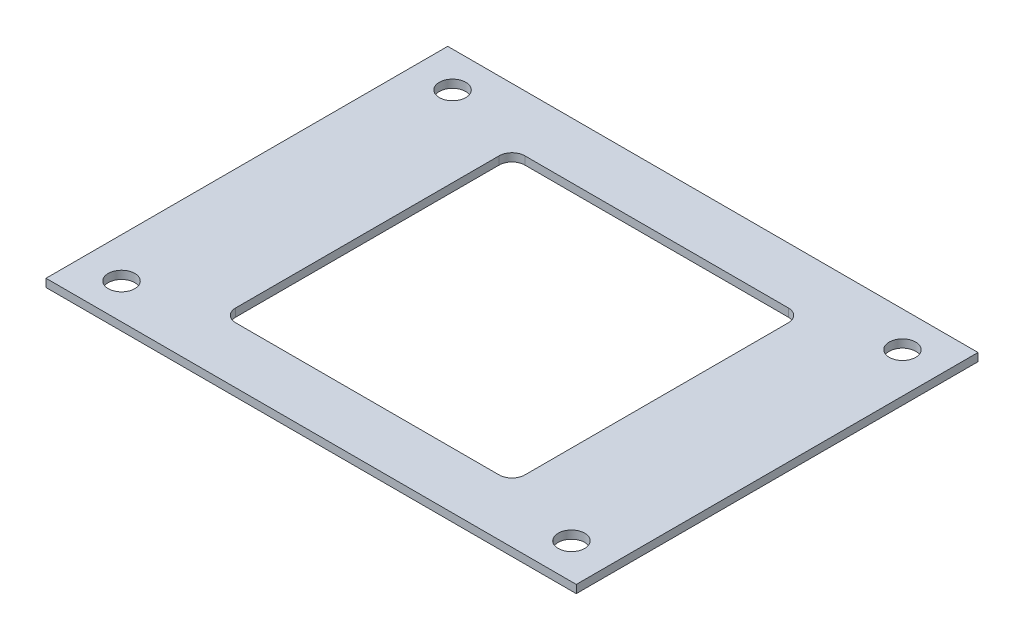
ISO-10303-21;
HEADER;
FILE_DESCRIPTION(('STEP AP214'),'2;1');
FILE_NAME('part.step','',(''),(''),'','','');
FILE_SCHEMA(('AUTOMOTIVE_DESIGN { 1 0 10303 214 1 1 1 1 }'));
ENDSEC;
DATA;
#1=APPLICATION_CONTEXT('core data for automotive mechanical design processes');
#2=APPLICATION_PROTOCOL_DEFINITION('international standard','automotive_design',2000,#1);
#3=PRODUCT_CONTEXT('',#1,'mechanical');
#4=PRODUCT('Part','Part','',(#3));
#5=PRODUCT_RELATED_PRODUCT_CATEGORY('part','',(#4));
#6=PRODUCT_DEFINITION_FORMATION('','',#4);
#7=PRODUCT_DEFINITION_CONTEXT('part definition',#1,'design');
#8=PRODUCT_DEFINITION('design','',#6,#7);
#9=PRODUCT_DEFINITION_SHAPE('','',#8);
#10=(LENGTH_UNIT() NAMED_UNIT(*) SI_UNIT(.MILLI.,.METRE.));
#11=(NAMED_UNIT(*) PLANE_ANGLE_UNIT() SI_UNIT($,.RADIAN.));
#12=(NAMED_UNIT(*) SI_UNIT($,.STERADIAN.) SOLID_ANGLE_UNIT());
#13=UNCERTAINTY_MEASURE_WITH_UNIT(LENGTH_MEASURE(1.E-05),#10,'distance_accuracy_value','');
#14=(GEOMETRIC_REPRESENTATION_CONTEXT(3) GLOBAL_UNCERTAINTY_ASSIGNED_CONTEXT((#13)) GLOBAL_UNIT_ASSIGNED_CONTEXT((#10,
#11,#12)) REPRESENTATION_CONTEXT('',''));
#15=CARTESIAN_POINT('',(0.,0.,0.));
#16=DIRECTION('',(0.,0.,1.));
#17=DIRECTION('',(1.,0.,0.));
#18=AXIS2_PLACEMENT_3D('',#15,#16,#17);
#19=CARTESIAN_POINT('',(0.,1.,0.));
#20=DIRECTION('',(0.,-1.,0.));
#21=DIRECTION('',(0.,0.,-1.));
#22=AXIS2_PLACEMENT_3D('',#19,#20,#21);
#23=PLANE('',#22);
#24=DIRECTION('',(0.,0.,-1.));
#25=VECTOR('',#24,1.);
#26=CARTESIAN_POINT('',(33.,1.,25.));
#27=LINE('',#26,#25);
#28=CARTESIAN_POINT('',(33.,1.,25.));
#29=VERTEX_POINT('',#28);
#30=CARTESIAN_POINT('',(33.,1.,-25.));
#31=VERTEX_POINT('',#30);
#32=EDGE_CURVE('E141',#29,#31,#27,.T.);
#33=ORIENTED_EDGE('',*,*,#32,.T.);
#34=DIRECTION('',(-1.,0.,0.));
#35=VECTOR('',#34,1.);
#36=CARTESIAN_POINT('',(-33.,1.,-25.));
#37=LINE('',#36,#35);
#38=CARTESIAN_POINT('',(-33.,1.,-25.));
#39=VERTEX_POINT('',#38);
#40=EDGE_CURVE('E130',#31,#39,#37,.T.);
#41=ORIENTED_EDGE('',*,*,#40,.T.);
#42=DIRECTION('',(0.,0.,1.));
#43=VECTOR('',#42,1.);
#44=CARTESIAN_POINT('',(-33.,1.,25.));
#45=LINE('',#44,#43);
#46=CARTESIAN_POINT('',(-33.,1.,25.));
#47=VERTEX_POINT('',#46);
#48=EDGE_CURVE('E140',#39,#47,#45,.T.);
#49=ORIENTED_EDGE('',*,*,#48,.T.);
#50=DIRECTION('',(1.,0.,0.));
#51=VECTOR('',#50,1.);
#52=CARTESIAN_POINT('',(-33.,1.,25.));
#53=LINE('',#52,#51);
#54=EDGE_CURVE('E145',#47,#29,#53,.T.);
#55=ORIENTED_EDGE('',*,*,#54,.T.);
#56=EDGE_LOOP('',(#33,#41,#49,#55));
#57=FACE_BOUND('',#56,.T.);
#58=DIRECTION('',(0.,0.,-1.));
#59=VECTOR('',#58,1.);
#60=CARTESIAN_POINT('',(18.,1.,18.));
#61=LINE('',#60,#59);
#62=CARTESIAN_POINT('',(18.,1.,16.4));
#63=VERTEX_POINT('',#62);
#64=CARTESIAN_POINT('',(18.,1.,-16.4));
#65=VERTEX_POINT('',#64);
#66=EDGE_CURVE('E210',#63,#65,#61,.T.);
#67=ORIENTED_EDGE('',*,*,#66,.F.);
#68=CARTESIAN_POINT('',(16.4,1.,16.4));
#69=DIRECTION('',(0.,-1.,0.));
#70=DIRECTION('',(0.,0.,-1.));
#71=AXIS2_PLACEMENT_3D('',#68,#69,#70);
#72=CIRCLE('',#71,1.6);
#73=CARTESIAN_POINT('',(16.4,1.,18.));
#74=VERTEX_POINT('',#73);
#75=EDGE_CURVE('E184',#63,#74,#72,.T.);
#76=ORIENTED_EDGE('',*,*,#75,.T.);
#77=DIRECTION('',(1.,0.,0.));
#78=VECTOR('',#77,1.);
#79=CARTESIAN_POINT('',(-18.,1.,18.));
#80=LINE('',#79,#78);
#81=CARTESIAN_POINT('',(-16.4,1.,18.));
#82=VERTEX_POINT('',#81);
#83=EDGE_CURVE('E212',#82,#74,#80,.T.);
#84=ORIENTED_EDGE('',*,*,#83,.F.);
#85=CARTESIAN_POINT('',(-16.4,1.,16.4));
#86=DIRECTION('',(0.,-1.,0.));
#87=DIRECTION('',(0.,0.,-1.));
#88=AXIS2_PLACEMENT_3D('',#85,#86,#87);
#89=CIRCLE('',#88,1.6);
#90=CARTESIAN_POINT('',(-18.,1.,16.4));
#91=VERTEX_POINT('',#90);
#92=EDGE_CURVE('E180',#82,#91,#89,.T.);
#93=ORIENTED_EDGE('',*,*,#92,.T.);
#94=DIRECTION('',(0.,0.,1.));
#95=VECTOR('',#94,1.);
#96=CARTESIAN_POINT('',(-18.,1.,18.));
#97=LINE('',#96,#95);
#98=CARTESIAN_POINT('',(-18.,1.,-16.4));
#99=VERTEX_POINT('',#98);
#100=EDGE_CURVE('E209',#99,#91,#97,.T.);
#101=ORIENTED_EDGE('',*,*,#100,.F.);
#102=CARTESIAN_POINT('',(-16.4,1.,-16.4));
#103=DIRECTION('',(0.,-1.,0.));
#104=DIRECTION('',(0.,0.,-1.));
#105=AXIS2_PLACEMENT_3D('',#102,#103,#104);
#106=CIRCLE('',#105,1.6);
#107=CARTESIAN_POINT('',(-16.4,1.,-18.));
#108=VERTEX_POINT('',#107);
#109=EDGE_CURVE('E11',#99,#108,#106,.T.);
#110=ORIENTED_EDGE('',*,*,#109,.T.);
#111=DIRECTION('',(-1.,0.,0.));
#112=VECTOR('',#111,1.);
#113=CARTESIAN_POINT('',(-18.,1.,-18.));
#114=LINE('',#113,#112);
#115=CARTESIAN_POINT('',(16.4,1.,-18.));
#116=VERTEX_POINT('',#115);
#117=EDGE_CURVE('E207',#116,#108,#114,.T.);
#118=ORIENTED_EDGE('',*,*,#117,.F.);
#119=CARTESIAN_POINT('',(16.4,1.,-16.4));
#120=DIRECTION('',(0.,-1.,0.));
#121=DIRECTION('',(0.,0.,-1.));
#122=AXIS2_PLACEMENT_3D('',#119,#120,#121);
#123=CIRCLE('',#122,1.6);
#124=EDGE_CURVE('E188',#116,#65,#123,.T.);
#125=ORIENTED_EDGE('',*,*,#124,.T.);
#126=EDGE_LOOP('',(#67,#76,#84,#93,#101,#110,#118,#125));
#127=FACE_BOUND('',#126,.T.);
#128=CARTESIAN_POINT('',(-28.,1.,-20.6));
#129=DIRECTION('',(0.,1.,0.));
#130=DIRECTION('',(0.,0.,1.));
#131=AXIS2_PLACEMENT_3D('',#128,#129,#130);
#132=CIRCLE('',#131,1.65);
#133=CARTESIAN_POINT('',(-28.,1.,-18.95));
#134=VERTEX_POINT('',#133);
#135=EDGE_CURVE('E223',#134,#134,#132,.T.);
#136=ORIENTED_EDGE('',*,*,#135,.F.);
#137=EDGE_LOOP('',(#136));
#138=FACE_BOUND('',#137,.T.);
#139=CARTESIAN_POINT('',(-28.,1.,20.6));
#140=DIRECTION('',(0.,1.,0.));
#141=DIRECTION('',(0.,0.,1.));
#142=AXIS2_PLACEMENT_3D('',#139,#140,#141);
#143=CIRCLE('',#142,1.65);
#144=CARTESIAN_POINT('',(-28.,1.,22.25));
#145=VERTEX_POINT('',#144);
#146=EDGE_CURVE('E313',#145,#145,#143,.T.);
#147=ORIENTED_EDGE('',*,*,#146,.F.);
#148=EDGE_LOOP('',(#147));
#149=FACE_BOUND('',#148,.T.);
#150=CARTESIAN_POINT('',(28.,1.,-20.6));
#151=DIRECTION('',(0.,1.,0.));
#152=DIRECTION('',(0.,0.,1.));
#153=AXIS2_PLACEMENT_3D('',#150,#151,#152);
#154=CIRCLE('',#153,1.65);
#155=CARTESIAN_POINT('',(28.,1.,-18.95));
#156=VERTEX_POINT('',#155);
#157=EDGE_CURVE('E307',#156,#156,#154,.T.);
#158=ORIENTED_EDGE('',*,*,#157,.F.);
#159=EDGE_LOOP('',(#158));
#160=FACE_BOUND('',#159,.T.);
#161=CARTESIAN_POINT('',(28.,1.,20.6));
#162=DIRECTION('',(0.,1.,0.));
#163=DIRECTION('',(0.,0.,1.));
#164=AXIS2_PLACEMENT_3D('',#161,#162,#163);
#165=CIRCLE('',#164,1.65);
#166=CARTESIAN_POINT('',(28.,1.,22.25));
#167=VERTEX_POINT('',#166);
#168=EDGE_CURVE('E298',#167,#167,#165,.T.);
#169=ORIENTED_EDGE('',*,*,#168,.F.);
#170=EDGE_LOOP('',(#169));
#171=FACE_BOUND('',#170,.T.);
#172=ADVANCED_FACE('F41',(#57,#127,#138,#149,#160,#171),#23,.F.);
#173=CARTESIAN_POINT('',(0.,0.,0.));
#174=DIRECTION('',(0.,-1.,0.));
#175=DIRECTION('',(0.,0.,-1.));
#176=AXIS2_PLACEMENT_3D('',#173,#174,#175);
#177=PLANE('',#176);
#178=CARTESIAN_POINT('',(28.,0.,-20.6));
#179=DIRECTION('',(0.,1.,0.));
#180=DIRECTION('',(0.,0.,1.));
#181=AXIS2_PLACEMENT_3D('',#178,#179,#180);
#182=CIRCLE('',#181,1.65);
#183=CARTESIAN_POINT('',(28.,0.,-18.95));
#184=VERTEX_POINT('',#183);
#185=EDGE_CURVE('E304',#184,#184,#182,.T.);
#186=ORIENTED_EDGE('',*,*,#185,.T.);
#187=EDGE_LOOP('',(#186));
#188=FACE_BOUND('',#187,.T.);
#189=CARTESIAN_POINT('',(-28.,0.,-20.6));
#190=DIRECTION('',(0.,1.,0.));
#191=DIRECTION('',(0.,0.,1.));
#192=AXIS2_PLACEMENT_3D('',#189,#190,#191);
#193=CIRCLE('',#192,1.65);
#194=CARTESIAN_POINT('',(-28.,0.,-18.95));
#195=VERTEX_POINT('',#194);
#196=EDGE_CURVE('E316',#195,#195,#193,.T.);
#197=ORIENTED_EDGE('',*,*,#196,.T.);
#198=EDGE_LOOP('',(#197));
#199=FACE_BOUND('',#198,.T.);
#200=DIRECTION('',(0.,0.,-1.));
#201=VECTOR('',#200,1.);
#202=CARTESIAN_POINT('',(33.,0.,25.));
#203=LINE('',#202,#201);
#204=CARTESIAN_POINT('',(33.,0.,25.));
#205=VERTEX_POINT('',#204);
#206=CARTESIAN_POINT('',(33.,0.,-25.));
#207=VERTEX_POINT('',#206);
#208=EDGE_CURVE('E153',#205,#207,#203,.T.);
#209=ORIENTED_EDGE('',*,*,#208,.F.);
#210=DIRECTION('',(1.,0.,0.));
#211=VECTOR('',#210,1.);
#212=CARTESIAN_POINT('',(-33.,0.,25.));
#213=LINE('',#212,#211);
#214=CARTESIAN_POINT('',(-33.,0.,25.));
#215=VERTEX_POINT('',#214);
#216=EDGE_CURVE('E149',#215,#205,#213,.T.);
#217=ORIENTED_EDGE('',*,*,#216,.F.);
#218=DIRECTION('',(0.,0.,1.));
#219=VECTOR('',#218,1.);
#220=CARTESIAN_POINT('',(-33.,0.,25.));
#221=LINE('',#220,#219);
#222=CARTESIAN_POINT('',(-33.,0.,-25.));
#223=VERTEX_POINT('',#222);
#224=EDGE_CURVE('E233',#223,#215,#221,.T.);
#225=ORIENTED_EDGE('',*,*,#224,.F.);
#226=DIRECTION('',(-1.,0.,0.));
#227=VECTOR('',#226,1.);
#228=CARTESIAN_POINT('',(-33.,0.,-25.));
#229=LINE('',#228,#227);
#230=EDGE_CURVE('E231',#207,#223,#229,.T.);
#231=ORIENTED_EDGE('',*,*,#230,.F.);
#232=EDGE_LOOP('',(#209,#217,#225,#231));
#233=FACE_BOUND('',#232,.T.);
#234=DIRECTION('',(0.,0.,1.));
#235=VECTOR('',#234,1.);
#236=CARTESIAN_POINT('',(-18.,0.,18.));
#237=LINE('',#236,#235);
#238=CARTESIAN_POINT('',(-18.,0.,-16.4));
#239=VERTEX_POINT('',#238);
#240=CARTESIAN_POINT('',(-18.,0.,16.4));
#241=VERTEX_POINT('',#240);
#242=EDGE_CURVE('E195',#239,#241,#237,.T.);
#243=ORIENTED_EDGE('',*,*,#242,.T.);
#244=CARTESIAN_POINT('',(-16.4,0.,16.4));
#245=DIRECTION('',(0.,-1.,0.));
#246=DIRECTION('',(0.,0.,-1.));
#247=AXIS2_PLACEMENT_3D('',#244,#245,#246);
#248=CIRCLE('',#247,1.6);
#249=CARTESIAN_POINT('',(-16.4,0.,18.));
#250=VERTEX_POINT('',#249);
#251=EDGE_CURVE('E178',#241,#250,#248,.F.);
#252=ORIENTED_EDGE('',*,*,#251,.T.);
#253=DIRECTION('',(1.,0.,0.));
#254=VECTOR('',#253,1.);
#255=CARTESIAN_POINT('',(-18.,0.,18.));
#256=LINE('',#255,#254);
#257=CARTESIAN_POINT('',(16.4,0.,18.));
#258=VERTEX_POINT('',#257);
#259=EDGE_CURVE('E204',#250,#258,#256,.T.);
#260=ORIENTED_EDGE('',*,*,#259,.T.);
#261=CARTESIAN_POINT('',(16.4,0.,16.4));
#262=DIRECTION('',(0.,-1.,0.));
#263=DIRECTION('',(0.,0.,-1.));
#264=AXIS2_PLACEMENT_3D('',#261,#262,#263);
#265=CIRCLE('',#264,1.6);
#266=CARTESIAN_POINT('',(18.,0.,16.4));
#267=VERTEX_POINT('',#266);
#268=EDGE_CURVE('E182',#258,#267,#265,.F.);
#269=ORIENTED_EDGE('',*,*,#268,.T.);
#270=DIRECTION('',(0.,0.,-1.));
#271=VECTOR('',#270,1.);
#272=CARTESIAN_POINT('',(18.,0.,18.));
#273=LINE('',#272,#271);
#274=CARTESIAN_POINT('',(18.,0.,-16.4));
#275=VERTEX_POINT('',#274);
#276=EDGE_CURVE('E220',#267,#275,#273,.T.);
#277=ORIENTED_EDGE('',*,*,#276,.T.);
#278=CARTESIAN_POINT('',(16.4,0.,-16.4));
#279=DIRECTION('',(0.,-1.,0.));
#280=DIRECTION('',(0.,0.,-1.));
#281=AXIS2_PLACEMENT_3D('',#278,#279,#280);
#282=CIRCLE('',#281,1.6);
#283=CARTESIAN_POINT('',(16.4,0.,-18.));
#284=VERTEX_POINT('',#283);
#285=EDGE_CURVE('E186',#275,#284,#282,.F.);
#286=ORIENTED_EDGE('',*,*,#285,.T.);
#287=DIRECTION('',(-1.,0.,0.));
#288=VECTOR('',#287,1.);
#289=CARTESIAN_POINT('',(-18.,0.,-18.));
#290=LINE('',#289,#288);
#291=CARTESIAN_POINT('',(-16.4,0.,-18.));
#292=VERTEX_POINT('',#291);
#293=EDGE_CURVE('E196',#284,#292,#290,.T.);
#294=ORIENTED_EDGE('',*,*,#293,.T.);
#295=CARTESIAN_POINT('',(-16.4,0.,-16.4));
#296=DIRECTION('',(0.,-1.,0.));
#297=DIRECTION('',(0.,0.,-1.));
#298=AXIS2_PLACEMENT_3D('',#295,#296,#297);
#299=CIRCLE('',#298,1.6);
#300=EDGE_CURVE('E49',#292,#239,#299,.F.);
#301=ORIENTED_EDGE('',*,*,#300,.T.);
#302=EDGE_LOOP('',(#243,#252,#260,#269,#277,#286,#294,#301));
#303=FACE_BOUND('',#302,.T.);
#304=CARTESIAN_POINT('',(-28.,0.,20.6));
#305=DIRECTION('',(0.,1.,0.));
#306=DIRECTION('',(0.,0.,1.));
#307=AXIS2_PLACEMENT_3D('',#304,#305,#306);
#308=CIRCLE('',#307,1.65);
#309=CARTESIAN_POINT('',(-28.,0.,22.25));
#310=VERTEX_POINT('',#309);
#311=EDGE_CURVE('E310',#310,#310,#308,.T.);
#312=ORIENTED_EDGE('',*,*,#311,.T.);
#313=EDGE_LOOP('',(#312));
#314=FACE_BOUND('',#313,.T.);
#315=CARTESIAN_POINT('',(28.,0.,20.6));
#316=DIRECTION('',(0.,1.,0.));
#317=DIRECTION('',(0.,0.,1.));
#318=AXIS2_PLACEMENT_3D('',#315,#316,#317);
#319=CIRCLE('',#318,1.65);
#320=CARTESIAN_POINT('',(28.,0.,22.25));
#321=VERTEX_POINT('',#320);
#322=EDGE_CURVE('E301',#321,#321,#319,.T.);
#323=ORIENTED_EDGE('',*,*,#322,.T.);
#324=EDGE_LOOP('',(#323));
#325=FACE_BOUND('',#324,.T.);
#326=ADVANCED_FACE('F193',(#188,#199,#233,#303,#314,#325),#177,.T.);
#327=CARTESIAN_POINT('',(33.,1.,25.));
#328=DIRECTION('',(-1.,0.,0.));
#329=DIRECTION('',(0.,0.,1.));
#330=AXIS2_PLACEMENT_3D('',#327,#328,#329);
#331=PLANE('',#330);
#332=ORIENTED_EDGE('',*,*,#208,.T.);
#333=DIRECTION('',(0.,-1.,0.));
#334=VECTOR('',#333,1.);
#335=CARTESIAN_POINT('',(33.,1.,-25.));
#336=LINE('',#335,#334);
#337=EDGE_CURVE('E134',#31,#207,#336,.T.);
#338=ORIENTED_EDGE('',*,*,#337,.F.);
#339=ORIENTED_EDGE('',*,*,#32,.F.);
#340=DIRECTION('',(0.,-1.,0.));
#341=VECTOR('',#340,1.);
#342=CARTESIAN_POINT('',(33.,1.,25.));
#343=LINE('',#342,#341);
#344=EDGE_CURVE('E229',#29,#205,#343,.T.);
#345=ORIENTED_EDGE('',*,*,#344,.T.);
#346=EDGE_LOOP('',(#332,#338,#339,#345));
#347=FACE_BOUND('',#346,.T.);
#348=ADVANCED_FACE('F151',(#347),#331,.F.);
#349=CARTESIAN_POINT('',(-33.,1.,-25.));
#350=DIRECTION('',(0.,0.,1.));
#351=DIRECTION('',(1.,0.,0.));
#352=AXIS2_PLACEMENT_3D('',#349,#350,#351);
#353=PLANE('',#352);
#354=ORIENTED_EDGE('',*,*,#230,.T.);
#355=DIRECTION('',(0.,-1.,0.));
#356=VECTOR('',#355,1.);
#357=CARTESIAN_POINT('',(-33.,1.,-25.));
#358=LINE('',#357,#356);
#359=EDGE_CURVE('E137',#39,#223,#358,.T.);
#360=ORIENTED_EDGE('',*,*,#359,.F.);
#361=ORIENTED_EDGE('',*,*,#40,.F.);
#362=ORIENTED_EDGE('',*,*,#337,.T.);
#363=EDGE_LOOP('',(#354,#360,#361,#362));
#364=FACE_BOUND('',#363,.T.);
#365=ADVANCED_FACE('F132',(#364),#353,.F.);
#366=CARTESIAN_POINT('',(-33.,1.,25.));
#367=DIRECTION('',(1.,0.,0.));
#368=DIRECTION('',(0.,0.,-1.));
#369=AXIS2_PLACEMENT_3D('',#366,#367,#368);
#370=PLANE('',#369);
#371=ORIENTED_EDGE('',*,*,#224,.T.);
#372=DIRECTION('',(0.,-1.,0.));
#373=VECTOR('',#372,1.);
#374=CARTESIAN_POINT('',(-33.,1.,25.));
#375=LINE('',#374,#373);
#376=EDGE_CURVE('E158',#47,#215,#375,.T.);
#377=ORIENTED_EDGE('',*,*,#376,.F.);
#378=ORIENTED_EDGE('',*,*,#48,.F.);
#379=ORIENTED_EDGE('',*,*,#359,.T.);
#380=EDGE_LOOP('',(#371,#377,#378,#379));
#381=FACE_BOUND('',#380,.T.);
#382=ADVANCED_FACE('F244',(#381),#370,.F.);
#383=CARTESIAN_POINT('',(-33.,1.,25.));
#384=DIRECTION('',(0.,0.,-1.));
#385=DIRECTION('',(-1.,0.,0.));
#386=AXIS2_PLACEMENT_3D('',#383,#384,#385);
#387=PLANE('',#386);
#388=ORIENTED_EDGE('',*,*,#216,.T.);
#389=ORIENTED_EDGE('',*,*,#344,.F.);
#390=ORIENTED_EDGE('',*,*,#54,.F.);
#391=ORIENTED_EDGE('',*,*,#376,.T.);
#392=EDGE_LOOP('',(#388,#389,#390,#391));
#393=FACE_BOUND('',#392,.T.);
#394=ADVANCED_FACE('F240',(#393),#387,.F.);
#395=CARTESIAN_POINT('',(18.,1.,18.));
#396=DIRECTION('',(-1.,0.,0.));
#397=DIRECTION('',(0.,0.,1.));
#398=AXIS2_PLACEMENT_3D('',#395,#396,#397);
#399=PLANE('',#398);
#400=ORIENTED_EDGE('',*,*,#276,.F.);
#401=DIRECTION('',(0.,-1.,0.));
#402=VECTOR('',#401,1.);
#403=CARTESIAN_POINT('',(18.,1.,16.4));
#404=LINE('',#403,#402);
#405=EDGE_CURVE('E172',#267,#63,#404,.F.);
#406=ORIENTED_EDGE('',*,*,#405,.T.);
#407=ORIENTED_EDGE('',*,*,#66,.T.);
#408=DIRECTION('',(0.,-1.,0.));
#409=VECTOR('',#408,1.);
#410=CARTESIAN_POINT('',(18.,0.,-16.4));
#411=LINE('',#410,#409);
#412=EDGE_CURVE('E169',#65,#275,#411,.T.);
#413=ORIENTED_EDGE('',*,*,#412,.T.);
#414=EDGE_LOOP('',(#400,#406,#407,#413));
#415=FACE_BOUND('',#414,.T.);
#416=ADVANCED_FACE('F251',(#415),#399,.T.);
#417=CARTESIAN_POINT('',(-18.,1.,-18.));
#418=DIRECTION('',(0.,0.,1.));
#419=DIRECTION('',(1.,0.,0.));
#420=AXIS2_PLACEMENT_3D('',#417,#418,#419);
#421=PLANE('',#420);
#422=ORIENTED_EDGE('',*,*,#293,.F.);
#423=DIRECTION('',(0.,-1.,0.));
#424=VECTOR('',#423,1.);
#425=CARTESIAN_POINT('',(16.4,1.,-18.));
#426=LINE('',#425,#424);
#427=EDGE_CURVE('E61',#284,#116,#426,.F.);
#428=ORIENTED_EDGE('',*,*,#427,.T.);
#429=ORIENTED_EDGE('',*,*,#117,.T.);
#430=DIRECTION('',(0.,-1.,0.));
#431=VECTOR('',#430,1.);
#432=CARTESIAN_POINT('',(-16.4,0.,-18.));
#433=LINE('',#432,#431);
#434=EDGE_CURVE('E174',#108,#292,#433,.T.);
#435=ORIENTED_EDGE('',*,*,#434,.T.);
#436=EDGE_LOOP('',(#422,#428,#429,#435));
#437=FACE_BOUND('',#436,.T.);
#438=ADVANCED_FACE('F206',(#437),#421,.T.);
#439=CARTESIAN_POINT('',(-18.,1.,18.));
#440=DIRECTION('',(1.,0.,0.));
#441=DIRECTION('',(0.,0.,-1.));
#442=AXIS2_PLACEMENT_3D('',#439,#440,#441);
#443=PLANE('',#442);
#444=ORIENTED_EDGE('',*,*,#100,.T.);
#445=DIRECTION('',(0.,-1.,0.));
#446=VECTOR('',#445,1.);
#447=CARTESIAN_POINT('',(-18.,0.,16.4));
#448=LINE('',#447,#446);
#449=EDGE_CURVE('E156',#91,#241,#448,.T.);
#450=ORIENTED_EDGE('',*,*,#449,.T.);
#451=ORIENTED_EDGE('',*,*,#242,.F.);
#452=DIRECTION('',(0.,-1.,0.));
#453=VECTOR('',#452,1.);
#454=CARTESIAN_POINT('',(-18.,1.,-16.4));
#455=LINE('',#454,#453);
#456=EDGE_CURVE('E154',#239,#99,#455,.F.);
#457=ORIENTED_EDGE('',*,*,#456,.T.);
#458=EDGE_LOOP('',(#444,#450,#451,#457));
#459=FACE_BOUND('',#458,.T.);
#460=ADVANCED_FACE('F202',(#459),#443,.T.);
#461=CARTESIAN_POINT('',(-18.,1.,18.));
#462=DIRECTION('',(0.,0.,-1.));
#463=DIRECTION('',(-1.,0.,0.));
#464=AXIS2_PLACEMENT_3D('',#461,#462,#463);
#465=PLANE('',#464);
#466=ORIENTED_EDGE('',*,*,#259,.F.);
#467=DIRECTION('',(0.,-1.,0.));
#468=VECTOR('',#467,1.);
#469=CARTESIAN_POINT('',(-16.4,1.,18.));
#470=LINE('',#469,#468);
#471=EDGE_CURVE('E167',#250,#82,#470,.F.);
#472=ORIENTED_EDGE('',*,*,#471,.T.);
#473=ORIENTED_EDGE('',*,*,#83,.T.);
#474=DIRECTION('',(0.,-1.,0.));
#475=VECTOR('',#474,1.);
#476=CARTESIAN_POINT('',(16.4,0.,18.));
#477=LINE('',#476,#475);
#478=EDGE_CURVE('E164',#74,#258,#477,.T.);
#479=ORIENTED_EDGE('',*,*,#478,.T.);
#480=EDGE_LOOP('',(#466,#472,#473,#479));
#481=FACE_BOUND('',#480,.T.);
#482=ADVANCED_FACE('F270',(#481),#465,.T.);
#483=CARTESIAN_POINT('',(-28.,1.,-20.6));
#484=DIRECTION('',(0.,-1.,0.));
#485=DIRECTION('',(0.,0.,-1.));
#486=AXIS2_PLACEMENT_3D('',#483,#484,#485);
#487=CYLINDRICAL_SURFACE('',#486,1.65);
#488=ORIENTED_EDGE('',*,*,#135,.T.);
#489=EDGE_LOOP('',(#488));
#490=FACE_BOUND('',#489,.T.);
#491=ORIENTED_EDGE('',*,*,#196,.F.);
#492=EDGE_LOOP('',(#491));
#493=FACE_BOUND('',#492,.T.);
#494=ADVANCED_FACE('F273',(#490,#493),#487,.F.);
#495=CARTESIAN_POINT('',(-28.,1.,20.6));
#496=DIRECTION('',(0.,-1.,0.));
#497=DIRECTION('',(0.,0.,-1.));
#498=AXIS2_PLACEMENT_3D('',#495,#496,#497);
#499=CYLINDRICAL_SURFACE('',#498,1.65);
#500=ORIENTED_EDGE('',*,*,#146,.T.);
#501=EDGE_LOOP('',(#500));
#502=FACE_BOUND('',#501,.T.);
#503=ORIENTED_EDGE('',*,*,#311,.F.);
#504=EDGE_LOOP('',(#503));
#505=FACE_BOUND('',#504,.T.);
#506=ADVANCED_FACE('F277',(#502,#505),#499,.F.);
#507=CARTESIAN_POINT('',(28.,1.,-20.6));
#508=DIRECTION('',(0.,-1.,0.));
#509=DIRECTION('',(0.,0.,-1.));
#510=AXIS2_PLACEMENT_3D('',#507,#508,#509);
#511=CYLINDRICAL_SURFACE('',#510,1.65);
#512=ORIENTED_EDGE('',*,*,#157,.T.);
#513=EDGE_LOOP('',(#512));
#514=FACE_BOUND('',#513,.T.);
#515=ORIENTED_EDGE('',*,*,#185,.F.);
#516=EDGE_LOOP('',(#515));
#517=FACE_BOUND('',#516,.T.);
#518=ADVANCED_FACE('F281',(#514,#517),#511,.F.);
#519=CARTESIAN_POINT('',(28.,1.,20.6));
#520=DIRECTION('',(0.,-1.,0.));
#521=DIRECTION('',(0.,0.,-1.));
#522=AXIS2_PLACEMENT_3D('',#519,#520,#521);
#523=CYLINDRICAL_SURFACE('',#522,1.65);
#524=ORIENTED_EDGE('',*,*,#168,.T.);
#525=EDGE_LOOP('',(#524));
#526=FACE_BOUND('',#525,.T.);
#527=ORIENTED_EDGE('',*,*,#322,.F.);
#528=EDGE_LOOP('',(#527));
#529=FACE_BOUND('',#528,.T.);
#530=ADVANCED_FACE('F285',(#526,#529),#523,.F.);
#531=CARTESIAN_POINT('',(-16.4,1.,16.4));
#532=DIRECTION('',(0.,1.,0.));
#533=DIRECTION('',(0.,0.,1.));
#534=AXIS2_PLACEMENT_3D('',#531,#532,#533);
#535=CYLINDRICAL_SURFACE('',#534,1.6);
#536=ORIENTED_EDGE('',*,*,#92,.F.);
#537=ORIENTED_EDGE('',*,*,#471,.F.);
#538=ORIENTED_EDGE('',*,*,#251,.F.);
#539=ORIENTED_EDGE('',*,*,#449,.F.);
#540=EDGE_LOOP('',(#536,#537,#538,#539));
#541=FACE_BOUND('',#540,.T.);
#542=ADVANCED_FACE('F287',(#541),#535,.F.);
#543=CARTESIAN_POINT('',(16.4,1.,16.4));
#544=DIRECTION('',(0.,1.,0.));
#545=DIRECTION('',(0.,0.,1.));
#546=AXIS2_PLACEMENT_3D('',#543,#544,#545);
#547=CYLINDRICAL_SURFACE('',#546,1.6);
#548=ORIENTED_EDGE('',*,*,#75,.F.);
#549=ORIENTED_EDGE('',*,*,#405,.F.);
#550=ORIENTED_EDGE('',*,*,#268,.F.);
#551=ORIENTED_EDGE('',*,*,#478,.F.);
#552=EDGE_LOOP('',(#548,#549,#550,#551));
#553=FACE_BOUND('',#552,.T.);
#554=ADVANCED_FACE('F292',(#553),#547,.F.);
#555=CARTESIAN_POINT('',(16.4,1.,-16.4));
#556=DIRECTION('',(0.,1.,0.));
#557=DIRECTION('',(0.,0.,1.));
#558=AXIS2_PLACEMENT_3D('',#555,#556,#557);
#559=CYLINDRICAL_SURFACE('',#558,1.6);
#560=ORIENTED_EDGE('',*,*,#124,.F.);
#561=ORIENTED_EDGE('',*,*,#427,.F.);
#562=ORIENTED_EDGE('',*,*,#285,.F.);
#563=ORIENTED_EDGE('',*,*,#412,.F.);
#564=EDGE_LOOP('',(#560,#561,#562,#563));
#565=FACE_BOUND('',#564,.T.);
#566=ADVANCED_FACE('F338',(#565),#559,.F.);
#567=CARTESIAN_POINT('',(-16.4,1.,-16.4));
#568=DIRECTION('',(0.,1.,0.));
#569=DIRECTION('',(0.,0.,1.));
#570=AXIS2_PLACEMENT_3D('',#567,#568,#569);
#571=CYLINDRICAL_SURFACE('',#570,1.6);
#572=ORIENTED_EDGE('',*,*,#109,.F.);
#573=ORIENTED_EDGE('',*,*,#456,.F.);
#574=ORIENTED_EDGE('',*,*,#300,.F.);
#575=ORIENTED_EDGE('',*,*,#434,.F.);
#576=EDGE_LOOP('',(#572,#573,#574,#575));
#577=FACE_BOUND('',#576,.T.);
#578=ADVANCED_FACE('F43',(#577),#571,.F.);
#579=CLOSED_SHELL('',(#172,#326,#348,#365,#382,#394,#416,#438,#460,#482,#494,#506,#518,#530,
#542,#554,#566,#578));
#580=MANIFOLD_SOLID_BREP('B2',#579);
#581=ADVANCED_BREP_SHAPE_REPRESENTATION('',(#18,#580),#14);
#582=SHAPE_DEFINITION_REPRESENTATION(#9,#581);
ENDSEC;
END-ISO-10303-21;
